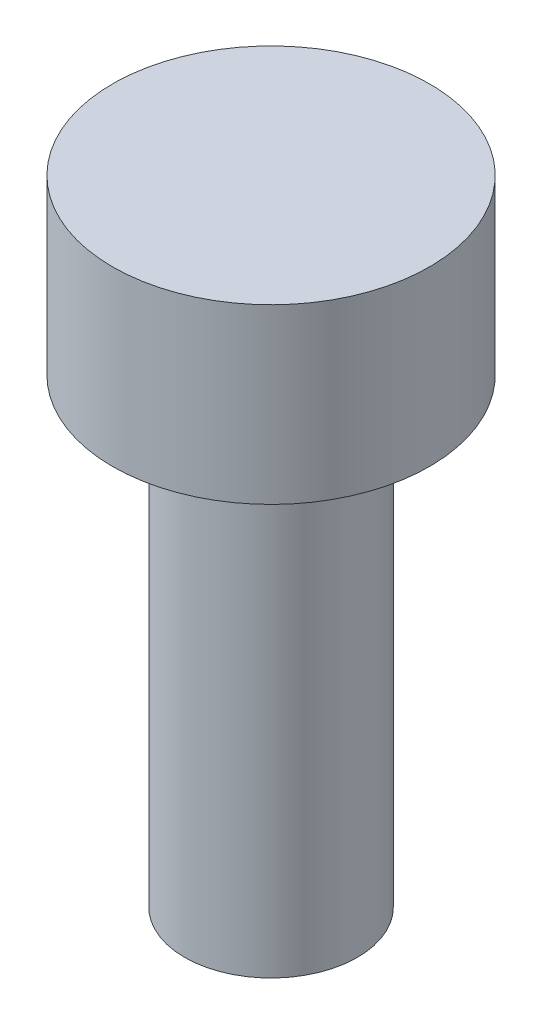
ISO-10303-21;
HEADER;
FILE_DESCRIPTION(('STEP AP214'),'2;1');
FILE_NAME('part.step','',(''),(''),'','','');
FILE_SCHEMA(('AUTOMOTIVE_DESIGN { 1 0 10303 214 1 1 1 1 }'));
ENDSEC;
DATA;
#1=APPLICATION_CONTEXT('core data for automotive mechanical design processes');
#2=APPLICATION_PROTOCOL_DEFINITION('international standard','automotive_design',2000,#1);
#3=PRODUCT_CONTEXT('',#1,'mechanical');
#4=PRODUCT('Part','Part','',(#3));
#5=PRODUCT_RELATED_PRODUCT_CATEGORY('part','',(#4));
#6=PRODUCT_DEFINITION_FORMATION('','',#4);
#7=PRODUCT_DEFINITION_CONTEXT('part definition',#1,'design');
#8=PRODUCT_DEFINITION('design','',#6,#7);
#9=PRODUCT_DEFINITION_SHAPE('','',#8);
#10=(LENGTH_UNIT() NAMED_UNIT(*) SI_UNIT(.MILLI.,.METRE.));
#11=(NAMED_UNIT(*) PLANE_ANGLE_UNIT() SI_UNIT($,.RADIAN.));
#12=(NAMED_UNIT(*) SI_UNIT($,.STERADIAN.) SOLID_ANGLE_UNIT());
#13=UNCERTAINTY_MEASURE_WITH_UNIT(LENGTH_MEASURE(1.E-05),#10,'distance_accuracy_value','');
#14=(GEOMETRIC_REPRESENTATION_CONTEXT(3) GLOBAL_UNCERTAINTY_ASSIGNED_CONTEXT((#13)) GLOBAL_UNIT_ASSIGNED_CONTEXT((#10,
#11,#12)) REPRESENTATION_CONTEXT('',''));
#15=CARTESIAN_POINT('',(0.,0.,0.));
#16=DIRECTION('',(0.,0.,1.));
#17=DIRECTION('',(1.,0.,0.));
#18=AXIS2_PLACEMENT_3D('',#15,#16,#17);
#19=CARTESIAN_POINT('',(1.5,-8.,0.));
#20=DIRECTION('',(0.,1.,0.));
#21=DIRECTION('',(0.,0.,1.));
#22=AXIS2_PLACEMENT_3D('',#19,#20,#21);
#23=PLANE('',#22);
#24=CARTESIAN_POINT('',(0.,-8.,0.));
#25=DIRECTION('',(0.,1.,0.));
#26=DIRECTION('',(0.,0.,1.));
#27=AXIS2_PLACEMENT_3D('',#24,#25,#26);
#28=CIRCLE('',#27,1.5);
#29=CARTESIAN_POINT('',(0.,-8.,1.5));
#30=VERTEX_POINT('',#29);
#31=EDGE_CURVE('E10',#30,#30,#28,.T.);
#32=ORIENTED_EDGE('',*,*,#31,.F.);
#33=EDGE_LOOP('',(#32));
#34=FACE_BOUND('',#33,.T.);
#35=ADVANCED_FACE('F30',(#34),#23,.F.);
#36=CARTESIAN_POINT('',(0.,9.90721096543505,0.));
#37=DIRECTION('',(0.,1.,0.));
#38=DIRECTION('',(0.,0.,1.));
#39=AXIS2_PLACEMENT_3D('',#36,#37,#38);
#40=CYLINDRICAL_SURFACE('',#39,1.5);
#41=CARTESIAN_POINT('',(0.,0.,0.));
#42=DIRECTION('',(0.,1.,0.));
#43=DIRECTION('',(0.,0.,1.));
#44=AXIS2_PLACEMENT_3D('',#41,#42,#43);
#45=CIRCLE('',#44,1.5);
#46=CARTESIAN_POINT('',(0.,0.,1.5));
#47=VERTEX_POINT('',#46);
#48=EDGE_CURVE('E36',#47,#47,#45,.T.);
#49=ORIENTED_EDGE('',*,*,#48,.F.);
#50=EDGE_LOOP('',(#49));
#51=FACE_BOUND('',#50,.T.);
#52=ORIENTED_EDGE('',*,*,#31,.T.);
#53=EDGE_LOOP('',(#52));
#54=FACE_BOUND('',#53,.T.);
#55=ADVANCED_FACE('F60',(#51,#54),#40,.T.);
#56=CARTESIAN_POINT('',(2.75,0.,0.));
#57=DIRECTION('',(0.,1.,0.));
#58=DIRECTION('',(0.,0.,1.));
#59=AXIS2_PLACEMENT_3D('',#56,#57,#58);
#60=PLANE('',#59);
#61=CARTESIAN_POINT('',(0.,0.,0.));
#62=DIRECTION('',(0.,1.,0.));
#63=DIRECTION('',(0.,0.,1.));
#64=AXIS2_PLACEMENT_3D('',#61,#62,#63);
#65=CIRCLE('',#64,2.75);
#66=CARTESIAN_POINT('',(0.,0.,2.75));
#67=VERTEX_POINT('',#66);
#68=EDGE_CURVE('E40',#67,#67,#65,.T.);
#69=ORIENTED_EDGE('',*,*,#68,.F.);
#70=EDGE_LOOP('',(#69));
#71=FACE_BOUND('',#70,.T.);
#72=ORIENTED_EDGE('',*,*,#48,.T.);
#73=EDGE_LOOP('',(#72));
#74=FACE_BOUND('',#73,.T.);
#75=ADVANCED_FACE('F55',(#71,#74),#60,.F.);
#76=CARTESIAN_POINT('',(0.,9.90721096543505,0.));
#77=DIRECTION('',(0.,1.,0.));
#78=DIRECTION('',(0.,0.,1.));
#79=AXIS2_PLACEMENT_3D('',#76,#77,#78);
#80=CYLINDRICAL_SURFACE('',#79,2.75);
#81=CARTESIAN_POINT('',(0.,3.,0.));
#82=DIRECTION('',(0.,1.,0.));
#83=DIRECTION('',(0.,0.,1.));
#84=AXIS2_PLACEMENT_3D('',#81,#82,#83);
#85=CIRCLE('',#84,2.75);
#86=CARTESIAN_POINT('',(0.,3.,2.75));
#87=VERTEX_POINT('',#86);
#88=EDGE_CURVE('E44',#87,#87,#85,.T.);
#89=ORIENTED_EDGE('',*,*,#88,.F.);
#90=EDGE_LOOP('',(#89));
#91=FACE_BOUND('',#90,.T.);
#92=ORIENTED_EDGE('',*,*,#68,.T.);
#93=EDGE_LOOP('',(#92));
#94=FACE_BOUND('',#93,.T.);
#95=ADVANCED_FACE('F52',(#91,#94),#80,.T.);
#96=CARTESIAN_POINT('',(0.,3.,0.));
#97=DIRECTION('',(0.,-1.,0.));
#98=DIRECTION('',(0.,0.,-1.));
#99=AXIS2_PLACEMENT_3D('',#96,#97,#98);
#100=PLANE('',#99);
#101=ORIENTED_EDGE('',*,*,#88,.T.);
#102=EDGE_LOOP('',(#101));
#103=FACE_BOUND('',#102,.T.);
#104=ADVANCED_FACE('F50',(#103),#100,.F.);
#105=CLOSED_SHELL('',(#35,#55,#75,#95,#104));
#106=MANIFOLD_SOLID_BREP('B2',#105);
#107=ADVANCED_BREP_SHAPE_REPRESENTATION('',(#18,#106),#14);
#108=SHAPE_DEFINITION_REPRESENTATION(#9,#107);
ENDSEC;
END-ISO-10303-21;
